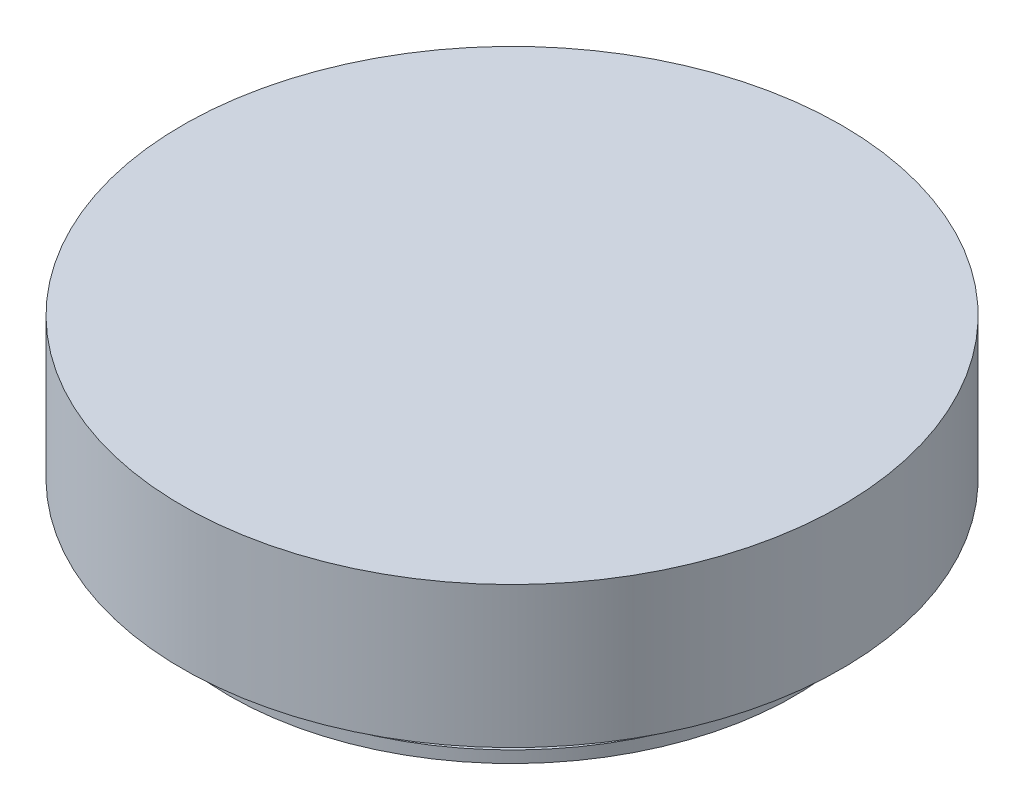
ISO-10303-21;
HEADER;
FILE_DESCRIPTION(('STEP AP214'),'2;1');
FILE_NAME('part.step','',(''),(''),'','','');
FILE_SCHEMA(('AUTOMOTIVE_DESIGN { 1 0 10303 214 1 1 1 1 }'));
ENDSEC;
DATA;
#1=APPLICATION_CONTEXT('core data for automotive mechanical design processes');
#2=APPLICATION_PROTOCOL_DEFINITION('international standard','automotive_design',2000,#1);
#3=PRODUCT_CONTEXT('',#1,'mechanical');
#4=PRODUCT('Part','Part','',(#3));
#5=PRODUCT_RELATED_PRODUCT_CATEGORY('part','',(#4));
#6=PRODUCT_DEFINITION_FORMATION('','',#4);
#7=PRODUCT_DEFINITION_CONTEXT('part definition',#1,'design');
#8=PRODUCT_DEFINITION('design','',#6,#7);
#9=PRODUCT_DEFINITION_SHAPE('','',#8);
#10=(LENGTH_UNIT() NAMED_UNIT(*) SI_UNIT(.MILLI.,.METRE.));
#11=(NAMED_UNIT(*) PLANE_ANGLE_UNIT() SI_UNIT($,.RADIAN.));
#12=(NAMED_UNIT(*) SI_UNIT($,.STERADIAN.) SOLID_ANGLE_UNIT());
#13=UNCERTAINTY_MEASURE_WITH_UNIT(LENGTH_MEASURE(1.E-05),#10,'distance_accuracy_value','');
#14=(GEOMETRIC_REPRESENTATION_CONTEXT(3) GLOBAL_UNCERTAINTY_ASSIGNED_CONTEXT((#13)) GLOBAL_UNIT_ASSIGNED_CONTEXT((#10,
#11,#12)) REPRESENTATION_CONTEXT('',''));
#15=CARTESIAN_POINT('',(0.,0.,0.));
#16=DIRECTION('',(0.,0.,1.));
#17=DIRECTION('',(1.,0.,0.));
#18=AXIS2_PLACEMENT_3D('',#15,#16,#17);
#19=CARTESIAN_POINT('',(0.,0.,0.));
#20=DIRECTION('',(0.,-1.,0.));
#21=DIRECTION('',(0.,0.,-1.));
#22=AXIS2_PLACEMENT_3D('',#19,#20,#21);
#23=CYLINDRICAL_SURFACE('',#22,38.1);
#24=CARTESIAN_POINT('',(0.,0.,0.));
#25=DIRECTION('',(0.,-1.,0.));
#26=DIRECTION('',(0.,0.,-1.));
#27=AXIS2_PLACEMENT_3D('',#24,#25,#26);
#28=CIRCLE('',#27,38.1);
#29=CARTESIAN_POINT('',(0.,0.,-38.1));
#30=VERTEX_POINT('',#29);
#31=EDGE_CURVE('E10',#30,#30,#28,.T.);
#32=ORIENTED_EDGE('',*,*,#31,.F.);
#33=EDGE_LOOP('',(#32));
#34=FACE_BOUND('',#33,.T.);
#35=CARTESIAN_POINT('',(0.,1.5875,0.));
#36=DIRECTION('',(0.,-1.,0.));
#37=DIRECTION('',(0.,0.,-1.));
#38=AXIS2_PLACEMENT_3D('',#35,#36,#37);
#39=CIRCLE('',#38,38.1);
#40=CARTESIAN_POINT('',(0.,1.5875,-38.1));
#41=VERTEX_POINT('',#40);
#42=EDGE_CURVE('E72',#41,#41,#39,.T.);
#43=ORIENTED_EDGE('',*,*,#42,.T.);
#44=EDGE_LOOP('',(#43));
#45=FACE_BOUND('',#44,.T.);
#46=ADVANCED_FACE('F37',(#34,#45),#23,.T.);
#47=CARTESIAN_POINT('',(-38.1,0.,0.));
#48=DIRECTION('',(0.,1.,0.));
#49=DIRECTION('',(0.,0.,1.));
#50=AXIS2_PLACEMENT_3D('',#47,#48,#49);
#51=PLANE('',#50);
#52=ORIENTED_EDGE('',*,*,#31,.T.);
#53=EDGE_LOOP('',(#52));
#54=FACE_BOUND('',#53,.T.);
#55=ADVANCED_FACE('F115',(#54),#51,.F.);
#56=CARTESIAN_POINT('',(0.,25.4,0.));
#57=DIRECTION('',(0.,-1.,0.));
#58=DIRECTION('',(0.,0.,-1.));
#59=AXIS2_PLACEMENT_3D('',#56,#57,#58);
#60=PLANE('',#59);
#61=CARTESIAN_POINT('',(0.,25.4,0.));
#62=DIRECTION('',(0.,-1.,0.));
#63=DIRECTION('',(0.,0.,-1.));
#64=AXIS2_PLACEMENT_3D('',#61,#62,#63);
#65=CIRCLE('',#64,44.45);
#66=CARTESIAN_POINT('',(0.,25.4,-44.45));
#67=VERTEX_POINT('',#66);
#68=EDGE_CURVE('E44',#67,#67,#65,.T.);
#69=ORIENTED_EDGE('',*,*,#68,.F.);
#70=EDGE_LOOP('',(#69));
#71=FACE_BOUND('',#70,.T.);
#72=ADVANCED_FACE('F110',(#71),#60,.F.);
#73=CARTESIAN_POINT('',(0.,0.,0.));
#74=DIRECTION('',(0.,-1.,0.));
#75=DIRECTION('',(0.,0.,-1.));
#76=AXIS2_PLACEMENT_3D('',#73,#74,#75);
#77=CYLINDRICAL_SURFACE('',#76,44.45);
#78=CARTESIAN_POINT('',(0.,6.35,0.));
#79=DIRECTION('',(0.,-1.,0.));
#80=DIRECTION('',(0.,0.,-1.));
#81=AXIS2_PLACEMENT_3D('',#78,#79,#80);
#82=CIRCLE('',#81,44.45);
#83=CARTESIAN_POINT('',(0.,6.35,-44.45));
#84=VERTEX_POINT('',#83);
#85=EDGE_CURVE('E49',#84,#84,#82,.T.);
#86=ORIENTED_EDGE('',*,*,#85,.F.);
#87=EDGE_LOOP('',(#86));
#88=FACE_BOUND('',#87,.T.);
#89=ORIENTED_EDGE('',*,*,#68,.T.);
#90=EDGE_LOOP('',(#89));
#91=FACE_BOUND('',#90,.T.);
#92=ADVANCED_FACE('F105',(#88,#91),#77,.T.);
#93=CARTESIAN_POINT('',(-44.45,6.35,0.));
#94=DIRECTION('',(0.,1.,0.));
#95=DIRECTION('',(0.,0.,1.));
#96=AXIS2_PLACEMENT_3D('',#93,#94,#95);
#97=PLANE('',#96);
#98=CARTESIAN_POINT('',(0.,6.35,0.));
#99=DIRECTION('',(0.,-1.,0.));
#100=DIRECTION('',(0.,0.,-1.));
#101=AXIS2_PLACEMENT_3D('',#98,#99,#100);
#102=CIRCLE('',#101,38.1);
#103=CARTESIAN_POINT('',(0.,6.35,-38.1));
#104=VERTEX_POINT('',#103);
#105=EDGE_CURVE('E54',#104,#104,#102,.T.);
#106=ORIENTED_EDGE('',*,*,#105,.F.);
#107=EDGE_LOOP('',(#106));
#108=FACE_BOUND('',#107,.T.);
#109=ORIENTED_EDGE('',*,*,#85,.T.);
#110=EDGE_LOOP('',(#109));
#111=FACE_BOUND('',#110,.T.);
#112=ADVANCED_FACE('F99',(#108,#111),#97,.F.);
#113=CARTESIAN_POINT('',(0.,0.,0.));
#114=DIRECTION('',(0.,-1.,0.));
#115=DIRECTION('',(0.,0.,-1.));
#116=AXIS2_PLACEMENT_3D('',#113,#114,#115);
#117=CYLINDRICAL_SURFACE('',#116,38.1);
#118=CARTESIAN_POINT('',(0.,4.3307,0.));
#119=DIRECTION('',(0.,-1.,0.));
#120=DIRECTION('',(0.,0.,-1.));
#121=AXIS2_PLACEMENT_3D('',#118,#119,#120);
#122=CIRCLE('',#121,38.1);
#123=CARTESIAN_POINT('',(0.,4.3307,-38.1));
#124=VERTEX_POINT('',#123);
#125=EDGE_CURVE('E60',#124,#124,#122,.T.);
#126=ORIENTED_EDGE('',*,*,#125,.F.);
#127=EDGE_LOOP('',(#126));
#128=FACE_BOUND('',#127,.T.);
#129=ORIENTED_EDGE('',*,*,#105,.T.);
#130=EDGE_LOOP('',(#129));
#131=FACE_BOUND('',#130,.T.);
#132=ADVANCED_FACE('F93',(#128,#131),#117,.T.);
#133=CARTESIAN_POINT('',(-38.1,4.3307,0.));
#134=DIRECTION('',(0.,1.,0.));
#135=DIRECTION('',(0.,0.,1.));
#136=AXIS2_PLACEMENT_3D('',#133,#134,#135);
#137=PLANE('',#136);
#138=CARTESIAN_POINT('',(0.,4.3307,0.));
#139=DIRECTION('',(0.,-1.,0.));
#140=DIRECTION('',(0.,0.,-1.));
#141=AXIS2_PLACEMENT_3D('',#138,#139,#140);
#142=CIRCLE('',#141,36.068);
#143=CARTESIAN_POINT('',(0.,4.3307,-36.068));
#144=VERTEX_POINT('',#143);
#145=EDGE_CURVE('E64',#144,#144,#142,.T.);
#146=ORIENTED_EDGE('',*,*,#145,.F.);
#147=EDGE_LOOP('',(#146));
#148=FACE_BOUND('',#147,.T.);
#149=ORIENTED_EDGE('',*,*,#125,.T.);
#150=EDGE_LOOP('',(#149));
#151=FACE_BOUND('',#150,.T.);
#152=ADVANCED_FACE('F87',(#148,#151),#137,.F.);
#153=CARTESIAN_POINT('',(0.,0.,0.));
#154=DIRECTION('',(0.,-1.,0.));
#155=DIRECTION('',(0.,0.,-1.));
#156=AXIS2_PLACEMENT_3D('',#153,#154,#155);
#157=CYLINDRICAL_SURFACE('',#156,36.068);
#158=CARTESIAN_POINT('',(0.,1.5875,0.));
#159=DIRECTION('',(0.,-1.,0.));
#160=DIRECTION('',(0.,0.,-1.));
#161=AXIS2_PLACEMENT_3D('',#158,#159,#160);
#162=CIRCLE('',#161,36.068);
#163=CARTESIAN_POINT('',(0.,1.5875,-36.068));
#164=VERTEX_POINT('',#163);
#165=EDGE_CURVE('E68',#164,#164,#162,.T.);
#166=ORIENTED_EDGE('',*,*,#165,.F.);
#167=EDGE_LOOP('',(#166));
#168=FACE_BOUND('',#167,.T.);
#169=ORIENTED_EDGE('',*,*,#145,.T.);
#170=EDGE_LOOP('',(#169));
#171=FACE_BOUND('',#170,.T.);
#172=ADVANCED_FACE('F81',(#168,#171),#157,.T.);
#173=CARTESIAN_POINT('',(-36.068,1.5875,0.));
#174=DIRECTION('',(0.,-1.,0.));
#175=DIRECTION('',(0.,0.,-1.));
#176=AXIS2_PLACEMENT_3D('',#173,#174,#175);
#177=PLANE('',#176);
#178=ORIENTED_EDGE('',*,*,#42,.F.);
#179=EDGE_LOOP('',(#178));
#180=FACE_BOUND('',#179,.T.);
#181=ORIENTED_EDGE('',*,*,#165,.T.);
#182=EDGE_LOOP('',(#181));
#183=FACE_BOUND('',#182,.T.);
#184=ADVANCED_FACE('F78',(#180,#183),#177,.F.);
#185=CLOSED_SHELL('',(#46,#55,#72,#92,#112,#132,#152,#172,#184));
#186=MANIFOLD_SOLID_BREP('B2',#185);
#187=ADVANCED_BREP_SHAPE_REPRESENTATION('',(#18,#186),#14);
#188=SHAPE_DEFINITION_REPRESENTATION(#9,#187);
ENDSEC;
END-ISO-10303-21;
